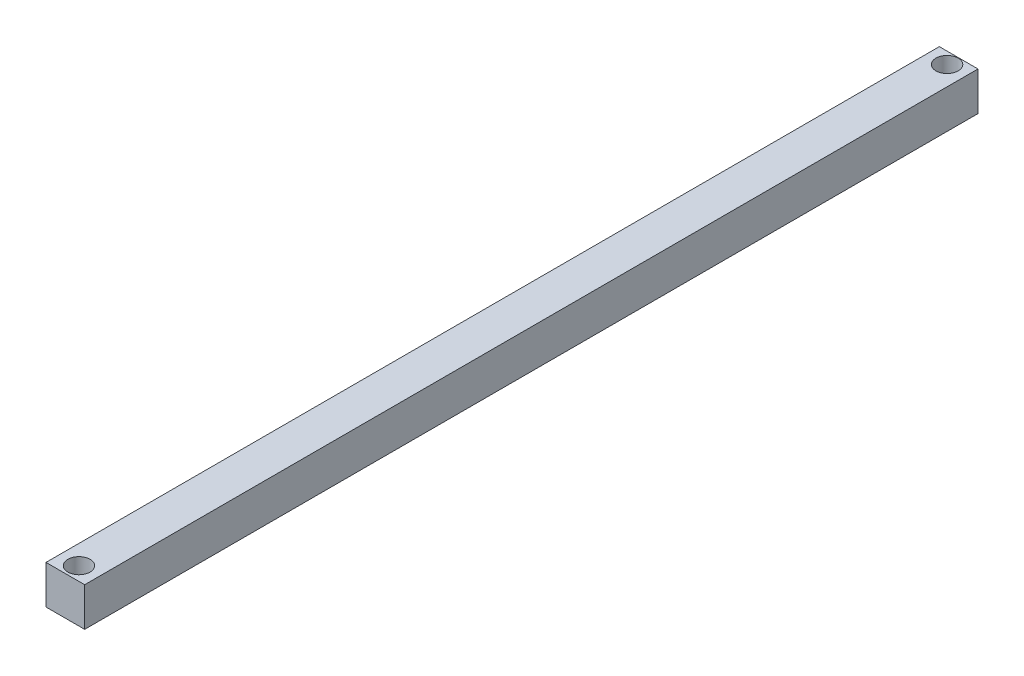
ISO-10303-21;
HEADER;
FILE_DESCRIPTION(('STEP AP214'),'2;1');
FILE_NAME('part.step','',(''),(''),'','','');
FILE_SCHEMA(('AUTOMOTIVE_DESIGN { 1 0 10303 214 1 1 1 1 }'));
ENDSEC;
DATA;
#1=APPLICATION_CONTEXT('core data for automotive mechanical design processes');
#2=APPLICATION_PROTOCOL_DEFINITION('international standard','automotive_design',2000,#1);
#3=PRODUCT_CONTEXT('',#1,'mechanical');
#4=PRODUCT('Part','Part','',(#3));
#5=PRODUCT_RELATED_PRODUCT_CATEGORY('part','',(#4));
#6=PRODUCT_DEFINITION_FORMATION('','',#4);
#7=PRODUCT_DEFINITION_CONTEXT('part definition',#1,'design');
#8=PRODUCT_DEFINITION('design','',#6,#7);
#9=PRODUCT_DEFINITION_SHAPE('','',#8);
#10=(LENGTH_UNIT() NAMED_UNIT(*) SI_UNIT(.MILLI.,.METRE.));
#11=(NAMED_UNIT(*) PLANE_ANGLE_UNIT() SI_UNIT($,.RADIAN.));
#12=(NAMED_UNIT(*) SI_UNIT($,.STERADIAN.) SOLID_ANGLE_UNIT());
#13=UNCERTAINTY_MEASURE_WITH_UNIT(LENGTH_MEASURE(1.E-05),#10,'distance_accuracy_value','');
#14=(GEOMETRIC_REPRESENTATION_CONTEXT(3) GLOBAL_UNCERTAINTY_ASSIGNED_CONTEXT((#13)) GLOBAL_UNIT_ASSIGNED_CONTEXT((#10,
#11,#12)) REPRESENTATION_CONTEXT('',''));
#15=CARTESIAN_POINT('',(0.,0.,0.));
#16=DIRECTION('',(0.,0.,1.));
#17=DIRECTION('',(1.,0.,0.));
#18=AXIS2_PLACEMENT_3D('',#15,#16,#17);
#19=CARTESIAN_POINT('',(9.99999999999997,20.,-231.));
#20=DIRECTION('',(-1.,0.,0.));
#21=DIRECTION('',(0.,0.,1.));
#22=AXIS2_PLACEMENT_3D('',#19,#20,#21);
#23=PLANE('',#22);
#24=DIRECTION('',(0.,0.,-1.));
#25=VECTOR('',#24,1.);
#26=CARTESIAN_POINT('',(9.99999999999997,0.,-231.));
#27=LINE('',#26,#25);
#28=CARTESIAN_POINT('',(10.,0.,231.));
#29=VERTEX_POINT('',#28);
#30=CARTESIAN_POINT('',(9.99999999999997,0.,-231.));
#31=VERTEX_POINT('',#30);
#32=EDGE_CURVE('E109',#29,#31,#27,.T.);
#33=ORIENTED_EDGE('',*,*,#32,.T.);
#34=DIRECTION('',(0.,-1.,0.));
#35=VECTOR('',#34,1.);
#36=CARTESIAN_POINT('',(9.99999999999997,20.,-231.));
#37=LINE('',#36,#35);
#38=CARTESIAN_POINT('',(9.99999999999997,20.,-231.));
#39=VERTEX_POINT('',#38);
#40=EDGE_CURVE('E11',#39,#31,#37,.T.);
#41=ORIENTED_EDGE('',*,*,#40,.F.);
#42=DIRECTION('',(0.,0.,-1.));
#43=VECTOR('',#42,1.);
#44=CARTESIAN_POINT('',(9.99999999999997,20.,-231.));
#45=LINE('',#44,#43);
#46=CARTESIAN_POINT('',(10.,20.,231.));
#47=VERTEX_POINT('',#46);
#48=EDGE_CURVE('E93',#47,#39,#45,.T.);
#49=ORIENTED_EDGE('',*,*,#48,.F.);
#50=DIRECTION('',(0.,-1.,0.));
#51=VECTOR('',#50,1.);
#52=CARTESIAN_POINT('',(10.,20.,231.));
#53=LINE('',#52,#51);
#54=EDGE_CURVE('E105',#47,#29,#53,.T.);
#55=ORIENTED_EDGE('',*,*,#54,.T.);
#56=EDGE_LOOP('',(#33,#41,#49,#55));
#57=FACE_BOUND('',#56,.T.);
#58=ADVANCED_FACE('F41',(#57),#23,.F.);
#59=CARTESIAN_POINT('',(-10.,20.,-231.));
#60=DIRECTION('',(0.,0.,1.));
#61=DIRECTION('',(1.,0.,0.));
#62=AXIS2_PLACEMENT_3D('',#59,#60,#61);
#63=PLANE('',#62);
#64=DIRECTION('',(-1.,0.,0.));
#65=VECTOR('',#64,1.);
#66=CARTESIAN_POINT('',(-10.,0.,-231.));
#67=LINE('',#66,#65);
#68=CARTESIAN_POINT('',(-10.,0.,-231.));
#69=VERTEX_POINT('',#68);
#70=EDGE_CURVE('E98',#31,#69,#67,.T.);
#71=ORIENTED_EDGE('',*,*,#70,.T.);
#72=DIRECTION('',(0.,-1.,0.));
#73=VECTOR('',#72,1.);
#74=CARTESIAN_POINT('',(-10.,20.,-231.));
#75=LINE('',#74,#73);
#76=CARTESIAN_POINT('',(-10.,20.,-231.));
#77=VERTEX_POINT('',#76);
#78=EDGE_CURVE('E50',#77,#69,#75,.T.);
#79=ORIENTED_EDGE('',*,*,#78,.F.);
#80=DIRECTION('',(-1.,0.,0.));
#81=VECTOR('',#80,1.);
#82=CARTESIAN_POINT('',(-10.,20.,-231.));
#83=LINE('',#82,#81);
#84=EDGE_CURVE('E88',#39,#77,#83,.T.);
#85=ORIENTED_EDGE('',*,*,#84,.F.);
#86=ORIENTED_EDGE('',*,*,#40,.T.);
#87=EDGE_LOOP('',(#71,#79,#85,#86));
#88=FACE_BOUND('',#87,.T.);
#89=ADVANCED_FACE('F97',(#88),#63,.F.);
#90=CARTESIAN_POINT('',(-10.,20.,-231.));
#91=DIRECTION('',(1.,0.,0.));
#92=DIRECTION('',(0.,0.,-1.));
#93=AXIS2_PLACEMENT_3D('',#90,#91,#92);
#94=PLANE('',#93);
#95=DIRECTION('',(0.,0.,1.));
#96=VECTOR('',#95,1.);
#97=CARTESIAN_POINT('',(-10.,0.,-231.));
#98=LINE('',#97,#96);
#99=CARTESIAN_POINT('',(-9.99999999999997,0.,231.));
#100=VERTEX_POINT('',#99);
#101=EDGE_CURVE('E75',#69,#100,#98,.T.);
#102=ORIENTED_EDGE('',*,*,#101,.T.);
#103=DIRECTION('',(0.,-1.,0.));
#104=VECTOR('',#103,1.);
#105=CARTESIAN_POINT('',(-9.99999999999997,20.,231.));
#106=LINE('',#105,#104);
#107=CARTESIAN_POINT('',(-9.99999999999997,20.,231.));
#108=VERTEX_POINT('',#107);
#109=EDGE_CURVE('E100',#108,#100,#106,.T.);
#110=ORIENTED_EDGE('',*,*,#109,.F.);
#111=DIRECTION('',(0.,0.,1.));
#112=VECTOR('',#111,1.);
#113=CARTESIAN_POINT('',(-10.,20.,-231.));
#114=LINE('',#113,#112);
#115=EDGE_CURVE('E91',#77,#108,#114,.T.);
#116=ORIENTED_EDGE('',*,*,#115,.F.);
#117=ORIENTED_EDGE('',*,*,#78,.T.);
#118=EDGE_LOOP('',(#102,#110,#116,#117));
#119=FACE_BOUND('',#118,.T.);
#120=ADVANCED_FACE('F101',(#119),#94,.F.);
#121=CARTESIAN_POINT('',(-9.99999999999997,20.,231.));
#122=DIRECTION('',(0.,0.,-1.));
#123=DIRECTION('',(-1.,0.,0.));
#124=AXIS2_PLACEMENT_3D('',#121,#122,#123);
#125=PLANE('',#124);
#126=DIRECTION('',(1.,0.,0.));
#127=VECTOR('',#126,1.);
#128=CARTESIAN_POINT('',(-9.99999999999997,0.,231.));
#129=LINE('',#128,#127);
#130=EDGE_CURVE('E81',#100,#29,#129,.T.);
#131=ORIENTED_EDGE('',*,*,#130,.T.);
#132=ORIENTED_EDGE('',*,*,#54,.F.);
#133=DIRECTION('',(1.,0.,0.));
#134=VECTOR('',#133,1.);
#135=CARTESIAN_POINT('',(-9.99999999999997,20.,231.));
#136=LINE('',#135,#134);
#137=EDGE_CURVE('E58',#108,#47,#136,.T.);
#138=ORIENTED_EDGE('',*,*,#137,.F.);
#139=ORIENTED_EDGE('',*,*,#109,.T.);
#140=EDGE_LOOP('',(#131,#132,#138,#139));
#141=FACE_BOUND('',#140,.T.);
#142=ADVANCED_FACE('F123',(#141),#125,.F.);
#143=CARTESIAN_POINT('',(0.,20.,0.));
#144=DIRECTION('',(0.,1.,0.));
#145=DIRECTION('',(0.,0.,1.));
#146=AXIS2_PLACEMENT_3D('',#143,#144,#145);
#147=PLANE('',#146);
#148=CARTESIAN_POINT('',(0.,20.,-225.));
#149=DIRECTION('',(0.,1.,0.));
#150=DIRECTION('',(0.,0.,1.));
#151=AXIS2_PLACEMENT_3D('',#148,#149,#150);
#152=CIRCLE('',#151,5.75000000000001);
#153=CARTESIAN_POINT('',(0.,20.,-219.25));
#154=VERTEX_POINT('',#153);
#155=EDGE_CURVE('E138',#154,#154,#152,.T.);
#156=ORIENTED_EDGE('',*,*,#155,.F.);
#157=EDGE_LOOP('',(#156));
#158=FACE_BOUND('',#157,.T.);
#159=CARTESIAN_POINT('',(0.,20.,223.96));
#160=DIRECTION('',(0.,1.,0.));
#161=DIRECTION('',(0.,0.,1.));
#162=AXIS2_PLACEMENT_3D('',#159,#160,#161);
#163=CIRCLE('',#162,5.75000000000001);
#164=CARTESIAN_POINT('',(0.,20.,229.71));
#165=VERTEX_POINT('',#164);
#166=EDGE_CURVE('E130',#165,#165,#163,.T.);
#167=ORIENTED_EDGE('',*,*,#166,.F.);
#168=EDGE_LOOP('',(#167));
#169=FACE_BOUND('',#168,.T.);
#170=ORIENTED_EDGE('',*,*,#48,.T.);
#171=ORIENTED_EDGE('',*,*,#84,.T.);
#172=ORIENTED_EDGE('',*,*,#115,.T.);
#173=ORIENTED_EDGE('',*,*,#137,.T.);
#174=EDGE_LOOP('',(#170,#171,#172,#173));
#175=FACE_BOUND('',#174,.T.);
#176=ADVANCED_FACE('F89',(#158,#169,#175),#147,.T.);
#177=CARTESIAN_POINT('',(0.,0.,0.));
#178=DIRECTION('',(0.,1.,0.));
#179=DIRECTION('',(0.,0.,1.));
#180=AXIS2_PLACEMENT_3D('',#177,#178,#179);
#181=PLANE('',#180);
#182=CARTESIAN_POINT('',(0.,0.,-225.));
#183=DIRECTION('',(0.,1.,0.));
#184=DIRECTION('',(0.,0.,1.));
#185=AXIS2_PLACEMENT_3D('',#182,#183,#184);
#186=CIRCLE('',#185,5.75000000000001);
#187=CARTESIAN_POINT('',(0.,0.,-219.25));
#188=VERTEX_POINT('',#187);
#189=EDGE_CURVE('E113',#188,#188,#186,.T.);
#190=ORIENTED_EDGE('',*,*,#189,.T.);
#191=EDGE_LOOP('',(#190));
#192=FACE_BOUND('',#191,.T.);
#193=CARTESIAN_POINT('',(0.,0.,223.96));
#194=DIRECTION('',(0.,1.,0.));
#195=DIRECTION('',(0.,0.,1.));
#196=AXIS2_PLACEMENT_3D('',#193,#194,#195);
#197=CIRCLE('',#196,5.75000000000001);
#198=CARTESIAN_POINT('',(0.,0.,229.71));
#199=VERTEX_POINT('',#198);
#200=EDGE_CURVE('E134',#199,#199,#197,.T.);
#201=ORIENTED_EDGE('',*,*,#200,.T.);
#202=EDGE_LOOP('',(#201));
#203=FACE_BOUND('',#202,.T.);
#204=ORIENTED_EDGE('',*,*,#32,.F.);
#205=ORIENTED_EDGE('',*,*,#130,.F.);
#206=ORIENTED_EDGE('',*,*,#101,.F.);
#207=ORIENTED_EDGE('',*,*,#70,.F.);
#208=EDGE_LOOP('',(#204,#205,#206,#207));
#209=FACE_BOUND('',#208,.T.);
#210=ADVANCED_FACE('F126',(#192,#203,#209),#181,.F.);
#211=CARTESIAN_POINT('',(0.,0.,223.96));
#212=DIRECTION('',(0.,1.,0.));
#213=DIRECTION('',(0.,0.,1.));
#214=AXIS2_PLACEMENT_3D('',#211,#212,#213);
#215=CYLINDRICAL_SURFACE('',#214,5.75000000000001);
#216=ORIENTED_EDGE('',*,*,#200,.F.);
#217=EDGE_LOOP('',(#216));
#218=FACE_BOUND('',#217,.T.);
#219=ORIENTED_EDGE('',*,*,#166,.T.);
#220=EDGE_LOOP('',(#219));
#221=FACE_BOUND('',#220,.T.);
#222=ADVANCED_FACE('F151',(#218,#221),#215,.F.);
#223=CARTESIAN_POINT('',(0.,0.,-225.));
#224=DIRECTION('',(0.,1.,0.));
#225=DIRECTION('',(0.,0.,1.));
#226=AXIS2_PLACEMENT_3D('',#223,#224,#225);
#227=CYLINDRICAL_SURFACE('',#226,5.75000000000001);
#228=ORIENTED_EDGE('',*,*,#189,.F.);
#229=EDGE_LOOP('',(#228));
#230=FACE_BOUND('',#229,.T.);
#231=ORIENTED_EDGE('',*,*,#155,.T.);
#232=EDGE_LOOP('',(#231));
#233=FACE_BOUND('',#232,.T.);
#234=ADVANCED_FACE('F148',(#230,#233),#227,.F.);
#235=CLOSED_SHELL('',(#58,#89,#120,#142,#176,#210,#222,#234));
#236=MANIFOLD_SOLID_BREP('B2',#235);
#237=ADVANCED_BREP_SHAPE_REPRESENTATION('',(#18,#236),#14);
#238=SHAPE_DEFINITION_REPRESENTATION(#9,#237);
ENDSEC;
END-ISO-10303-21;
